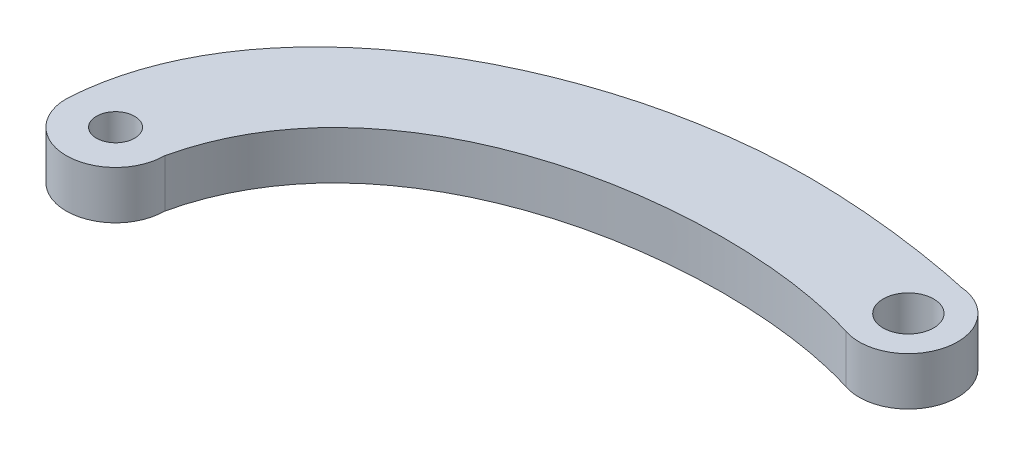
ISO-10303-21;
HEADER;
FILE_DESCRIPTION(('STEP AP214'),'2;1');
FILE_NAME('part.step','',(''),(''),'','','');
FILE_SCHEMA(('AUTOMOTIVE_DESIGN { 1 0 10303 214 1 1 1 1 }'));
ENDSEC;
DATA;
#1=APPLICATION_CONTEXT('core data for automotive mechanical design processes');
#2=APPLICATION_PROTOCOL_DEFINITION('international standard','automotive_design',2000,#1);
#3=PRODUCT_CONTEXT('',#1,'mechanical');
#4=PRODUCT('Part','Part','',(#3));
#5=PRODUCT_RELATED_PRODUCT_CATEGORY('part','',(#4));
#6=PRODUCT_DEFINITION_FORMATION('','',#4);
#7=PRODUCT_DEFINITION_CONTEXT('part definition',#1,'design');
#8=PRODUCT_DEFINITION('design','',#6,#7);
#9=PRODUCT_DEFINITION_SHAPE('','',#8);
#10=(LENGTH_UNIT() NAMED_UNIT(*) SI_UNIT(.MILLI.,.METRE.));
#11=(NAMED_UNIT(*) PLANE_ANGLE_UNIT() SI_UNIT($,.RADIAN.));
#12=(NAMED_UNIT(*) SI_UNIT($,.STERADIAN.) SOLID_ANGLE_UNIT());
#13=UNCERTAINTY_MEASURE_WITH_UNIT(LENGTH_MEASURE(1.E-05),#10,'distance_accuracy_value','');
#14=(GEOMETRIC_REPRESENTATION_CONTEXT(3) GLOBAL_UNCERTAINTY_ASSIGNED_CONTEXT((#13)) GLOBAL_UNIT_ASSIGNED_CONTEXT((#10,
#11,#12)) REPRESENTATION_CONTEXT('',''));
#15=CARTESIAN_POINT('',(0.,0.,0.));
#16=DIRECTION('',(0.,0.,1.));
#17=DIRECTION('',(1.,0.,0.));
#18=AXIS2_PLACEMENT_3D('',#15,#16,#17);
#19=CARTESIAN_POINT('',(5.97582309031203,3.9,-17.005674981798));
#20=DIRECTION('',(0.,1.,0.));
#21=DIRECTION('',(0.,0.,1.));
#22=AXIS2_PLACEMENT_3D('',#19,#20,#21);
#23=PLANE('',#22);
#24=CARTESIAN_POINT('',(-10.8200254514701,3.9,5.21517773339498));
#25=DIRECTION('',(0.,1.,0.));
#26=DIRECTION('',(0.,0.,1.));
#27=AXIS2_PLACEMENT_3D('',#24,#25,#26);
#28=CIRCLE('',#27,1.55);
#29=CARTESIAN_POINT('',(-10.8200254514701,3.9,6.76517773339498));
#30=VERTEX_POINT('',#29);
#31=EDGE_CURVE('E163',#30,#30,#28,.T.);
#32=ORIENTED_EDGE('',*,*,#31,.F.);
#33=EDGE_LOOP('',(#32));
#34=FACE_BOUND('',#33,.T.);
#35=CARTESIAN_POINT('',(34.7961533234878,3.9,-17.8711895321792));
#36=CARTESIAN_POINT('',(33.5182404998933,3.9,-18.1690513856111));
#37=CARTESIAN_POINT('',(10.7805347521748,3.9,-22.9478445351277));
#38=CARTESIAN_POINT('',(-14.0248919342879,3.9,-9.66832331569746));
#39=CARTESIAN_POINT('',(-14.8200254514701,3.9,5.21517773339498));
#40=B_SPLINE_CURVE_WITH_KNOTS('',3,(#35,#36,#37,#38,#39),.UNSPECIFIED.,.F.,.F.,(4,1,4),(0.,
0.307078619225043,1.),.UNSPECIFIED.);
#41=CARTESIAN_POINT('',(34.7961533234878,3.9,-17.8711895321792));
#42=VERTEX_POINT('',#41);
#43=CARTESIAN_POINT('',(-14.8200254514701,3.9,5.21517773339498));
#44=VERTEX_POINT('',#43);
#45=EDGE_CURVE('E99',#42,#44,#40,.T.);
#46=ORIENTED_EDGE('',*,*,#45,.T.);
#47=CARTESIAN_POINT('',(-10.8200254514701,3.9,5.21517773339498));
#48=DIRECTION('',(0.,1.,0.));
#49=DIRECTION('',(0.,0.,1.));
#50=AXIS2_PLACEMENT_3D('',#47,#48,#49);
#51=CIRCLE('',#50,4.);
#52=CARTESIAN_POINT('',(-6.82002545147011,3.9,5.21517773339498));
#53=VERTEX_POINT('',#52);
#54=EDGE_CURVE('E94',#44,#53,#51,.T.);
#55=ORIENTED_EDGE('',*,*,#54,.T.);
#56=CARTESIAN_POINT('',(-6.82002545147011,3.9,5.21517773339498));
#57=CARTESIAN_POINT('',(-3.10433649039434,3.9,-11.2262119934947));
#58=CARTESIAN_POINT('',(20.3043860606098,3.9,-14.0900598985144));
#59=CARTESIAN_POINT('',(33.1812685739472,3.9,-10.099401316528));
#60=B_SPLINE_CURVE_WITH_KNOTS('',3,(#56,#57,#58,#59),.UNSPECIFIED.,.F.,.F.,(4,4),(0.,1.),.UNSPECIFIED.);
#61=CARTESIAN_POINT('',(33.1812685739472,3.9,-10.099401316528));
#62=VERTEX_POINT('',#61);
#63=EDGE_CURVE('E97',#53,#62,#60,.T.);
#64=ORIENTED_EDGE('',*,*,#63,.T.);
#65=CARTESIAN_POINT('',(34.4761583722615,3.9,-13.8840096727812));
#66=DIRECTION('',(0.,1.,0.));
#67=DIRECTION('',(0.,0.,1.));
#68=AXIS2_PLACEMENT_3D('',#65,#66,#67);
#69=CIRCLE('',#68,4.);
#70=EDGE_CURVE('E64',#62,#42,#69,.T.);
#71=ORIENTED_EDGE('',*,*,#70,.T.);
#72=EDGE_LOOP('',(#46,#55,#64,#71));
#73=FACE_BOUND('',#72,.T.);
#74=CARTESIAN_POINT('',(34.4761583722615,3.9,-13.8840096727812));
#75=DIRECTION('',(0.,1.,0.));
#76=DIRECTION('',(0.,0.,1.));
#77=AXIS2_PLACEMENT_3D('',#74,#75,#76);
#78=CIRCLE('',#77,2.05);
#79=CARTESIAN_POINT('',(34.4761583722615,3.9,-11.8340096727812));
#80=VERTEX_POINT('',#79);
#81=EDGE_CURVE('E152',#80,#80,#78,.T.);
#82=ORIENTED_EDGE('',*,*,#81,.F.);
#83=EDGE_LOOP('',(#82));
#84=FACE_BOUND('',#83,.T.);
#85=ADVANCED_FACE('F45',(#34,#73,#84),#23,.T.);
#86=CARTESIAN_POINT('',(5.97582309031203,0.,-17.005674981798));
#87=DIRECTION('',(0.,1.,0.));
#88=DIRECTION('',(0.,0.,1.));
#89=AXIS2_PLACEMENT_3D('',#86,#87,#88);
#90=PLANE('',#89);
#91=CARTESIAN_POINT('',(34.7961533234878,0.,-17.8711895321792));
#92=CARTESIAN_POINT('',(33.5182404998933,0.,-18.1690513856111));
#93=CARTESIAN_POINT('',(10.7805347521748,0.,-22.9478445351277));
#94=CARTESIAN_POINT('',(-14.0248919342879,0.,-9.66832331569746));
#95=CARTESIAN_POINT('',(-14.8200254514701,0.,5.21517773339498));
#96=B_SPLINE_CURVE_WITH_KNOTS('',3,(#91,#92,#93,#94,#95),.UNSPECIFIED.,.F.,.F.,(4,1,4),(0.,
0.307078619225043,1.),.UNSPECIFIED.);
#97=CARTESIAN_POINT('',(34.7961533234878,0.,-17.8711895321792));
#98=VERTEX_POINT('',#97);
#99=CARTESIAN_POINT('',(-14.8200254514701,0.,5.21517773339498));
#100=VERTEX_POINT('',#99);
#101=EDGE_CURVE('E167',#98,#100,#96,.T.);
#102=ORIENTED_EDGE('',*,*,#101,.F.);
#103=CARTESIAN_POINT('',(34.4761583722615,0.,-13.8840096727812));
#104=DIRECTION('',(0.,1.,0.));
#105=DIRECTION('',(0.,0.,1.));
#106=AXIS2_PLACEMENT_3D('',#103,#104,#105);
#107=CIRCLE('',#106,4.);
#108=CARTESIAN_POINT('',(33.1812685739472,0.,-10.099401316528));
#109=VERTEX_POINT('',#108);
#110=EDGE_CURVE('E87',#109,#98,#107,.T.);
#111=ORIENTED_EDGE('',*,*,#110,.F.);
#112=CARTESIAN_POINT('',(-6.82002545147011,0.,5.21517773339498));
#113=CARTESIAN_POINT('',(-3.10433649039434,0.,-11.2262119934947));
#114=CARTESIAN_POINT('',(20.3043860606098,0.,-14.0900598985144));
#115=CARTESIAN_POINT('',(33.1812685739472,0.,-10.099401316528));
#116=B_SPLINE_CURVE_WITH_KNOTS('',3,(#112,#113,#114,#115),.UNSPECIFIED.,.F.,.F.,(4,4),(0.,1.),.UNSPECIFIED.);
#117=CARTESIAN_POINT('',(-6.82002545147011,0.,5.21517773339498));
#118=VERTEX_POINT('',#117);
#119=EDGE_CURVE('E81',#118,#109,#116,.T.);
#120=ORIENTED_EDGE('',*,*,#119,.F.);
#121=CARTESIAN_POINT('',(-10.8200254514701,0.,5.21517773339498));
#122=DIRECTION('',(0.,1.,0.));
#123=DIRECTION('',(0.,0.,1.));
#124=AXIS2_PLACEMENT_3D('',#121,#122,#123);
#125=CIRCLE('',#124,4.);
#126=EDGE_CURVE('E104',#100,#118,#125,.T.);
#127=ORIENTED_EDGE('',*,*,#126,.F.);
#128=EDGE_LOOP('',(#102,#111,#120,#127));
#129=FACE_BOUND('',#128,.T.);
#130=CARTESIAN_POINT('',(-10.8200254514701,0.,5.21517773339498));
#131=DIRECTION('',(0.,1.,0.));
#132=DIRECTION('',(0.,0.,1.));
#133=AXIS2_PLACEMENT_3D('',#130,#131,#132);
#134=CIRCLE('',#133,1.55);
#135=CARTESIAN_POINT('',(-10.8200254514701,0.,6.76517773339498));
#136=VERTEX_POINT('',#135);
#137=EDGE_CURVE('E160',#136,#136,#134,.T.);
#138=ORIENTED_EDGE('',*,*,#137,.T.);
#139=EDGE_LOOP('',(#138));
#140=FACE_BOUND('',#139,.T.);
#141=CARTESIAN_POINT('',(34.4761583722615,0.,-13.8840096727812));
#142=DIRECTION('',(0.,1.,0.));
#143=DIRECTION('',(0.,0.,1.));
#144=AXIS2_PLACEMENT_3D('',#141,#142,#143);
#145=CIRCLE('',#144,2.05);
#146=CARTESIAN_POINT('',(34.4761583722615,0.,-11.8340096727812));
#147=VERTEX_POINT('',#146);
#148=EDGE_CURVE('E155',#147,#147,#145,.T.);
#149=ORIENTED_EDGE('',*,*,#148,.T.);
#150=EDGE_LOOP('',(#149));
#151=FACE_BOUND('',#150,.T.);
#152=ADVANCED_FACE('F129',(#129,#140,#151),#90,.F.);
#153=DIRECTION('',(0.,-1.,0.));
#154=VECTOR('',#153,1.);
#155=SURFACE_OF_LINEAR_EXTRUSION('',#40,#154);
#156=ORIENTED_EDGE('',*,*,#101,.T.);
#157=DIRECTION('',(0.,-1.,0.));
#158=VECTOR('',#157,1.);
#159=CARTESIAN_POINT('',(-14.8200254514701,3.9,5.21517773339498));
#160=LINE('',#159,#158);
#161=EDGE_CURVE('E11',#44,#100,#160,.T.);
#162=ORIENTED_EDGE('',*,*,#161,.F.);
#163=ORIENTED_EDGE('',*,*,#45,.F.);
#164=DIRECTION('',(0.,-1.,0.));
#165=VECTOR('',#164,1.);
#166=CARTESIAN_POINT('',(34.7961533234878,3.9,-17.8711895321792));
#167=LINE('',#166,#165);
#168=EDGE_CURVE('E111',#42,#98,#167,.T.);
#169=ORIENTED_EDGE('',*,*,#168,.T.);
#170=EDGE_LOOP('',(#156,#162,#163,#169));
#171=FACE_BOUND('',#170,.T.);
#172=ADVANCED_FACE('F47',(#171),#155,.F.);
#173=CARTESIAN_POINT('',(-10.8200254514701,3.9,5.21517773339498));
#174=DIRECTION('',(0.,-1.,0.));
#175=DIRECTION('',(0.,0.,-1.));
#176=AXIS2_PLACEMENT_3D('',#173,#174,#175);
#177=CYLINDRICAL_SURFACE('',#176,4.);
#178=ORIENTED_EDGE('',*,*,#126,.T.);
#179=DIRECTION('',(0.,-1.,0.));
#180=VECTOR('',#179,1.);
#181=CARTESIAN_POINT('',(-6.82002545147011,3.9,5.21517773339498));
#182=LINE('',#181,#180);
#183=EDGE_CURVE('E56',#53,#118,#182,.T.);
#184=ORIENTED_EDGE('',*,*,#183,.F.);
#185=ORIENTED_EDGE('',*,*,#54,.F.);
#186=ORIENTED_EDGE('',*,*,#161,.T.);
#187=EDGE_LOOP('',(#178,#184,#185,#186));
#188=FACE_BOUND('',#187,.T.);
#189=ADVANCED_FACE('F103',(#188),#177,.T.);
#190=DIRECTION('',(0.,-1.,0.));
#191=VECTOR('',#190,1.);
#192=SURFACE_OF_LINEAR_EXTRUSION('',#60,#191);
#193=ORIENTED_EDGE('',*,*,#119,.T.);
#194=DIRECTION('',(0.,-1.,0.));
#195=VECTOR('',#194,1.);
#196=CARTESIAN_POINT('',(33.1812685739472,3.9,-10.099401316528));
#197=LINE('',#196,#195);
#198=EDGE_CURVE('E106',#62,#109,#197,.T.);
#199=ORIENTED_EDGE('',*,*,#198,.F.);
#200=ORIENTED_EDGE('',*,*,#63,.F.);
#201=ORIENTED_EDGE('',*,*,#183,.T.);
#202=EDGE_LOOP('',(#193,#199,#200,#201));
#203=FACE_BOUND('',#202,.T.);
#204=ADVANCED_FACE('F107',(#203),#192,.F.);
#205=CARTESIAN_POINT('',(34.4761583722615,3.9,-13.8840096727812));
#206=DIRECTION('',(0.,-1.,0.));
#207=DIRECTION('',(0.,0.,-1.));
#208=AXIS2_PLACEMENT_3D('',#205,#206,#207);
#209=CYLINDRICAL_SURFACE('',#208,4.);
#210=ORIENTED_EDGE('',*,*,#110,.T.);
#211=ORIENTED_EDGE('',*,*,#168,.F.);
#212=ORIENTED_EDGE('',*,*,#70,.F.);
#213=ORIENTED_EDGE('',*,*,#198,.T.);
#214=EDGE_LOOP('',(#210,#211,#212,#213));
#215=FACE_BOUND('',#214,.T.);
#216=ADVANCED_FACE('F123',(#215),#209,.T.);
#217=CARTESIAN_POINT('',(-10.8200254514701,3.9,5.21517773339498));
#218=DIRECTION('',(0.,-1.,0.));
#219=DIRECTION('',(0.,0.,-1.));
#220=AXIS2_PLACEMENT_3D('',#217,#218,#219);
#221=CYLINDRICAL_SURFACE('',#220,1.55);
#222=ORIENTED_EDGE('',*,*,#31,.T.);
#223=EDGE_LOOP('',(#222));
#224=FACE_BOUND('',#223,.T.);
#225=ORIENTED_EDGE('',*,*,#137,.F.);
#226=EDGE_LOOP('',(#225));
#227=FACE_BOUND('',#226,.T.);
#228=ADVANCED_FACE('F140',(#224,#227),#221,.F.);
#229=CARTESIAN_POINT('',(34.4761583722615,3.9,-13.8840096727812));
#230=DIRECTION('',(0.,-1.,0.));
#231=DIRECTION('',(0.,0.,-1.));
#232=AXIS2_PLACEMENT_3D('',#229,#230,#231);
#233=CYLINDRICAL_SURFACE('',#232,2.05);
#234=ORIENTED_EDGE('',*,*,#81,.T.);
#235=EDGE_LOOP('',(#234));
#236=FACE_BOUND('',#235,.T.);
#237=ORIENTED_EDGE('',*,*,#148,.F.);
#238=EDGE_LOOP('',(#237));
#239=FACE_BOUND('',#238,.T.);
#240=ADVANCED_FACE('F143',(#236,#239),#233,.F.);
#241=CLOSED_SHELL('',(#85,#152,#172,#189,#204,#216,#228,#240));
#242=MANIFOLD_SOLID_BREP('B2',#241);
#243=ADVANCED_BREP_SHAPE_REPRESENTATION('',(#18,#242),#14);
#244=SHAPE_DEFINITION_REPRESENTATION(#9,#243);
ENDSEC;
END-ISO-10303-21;
